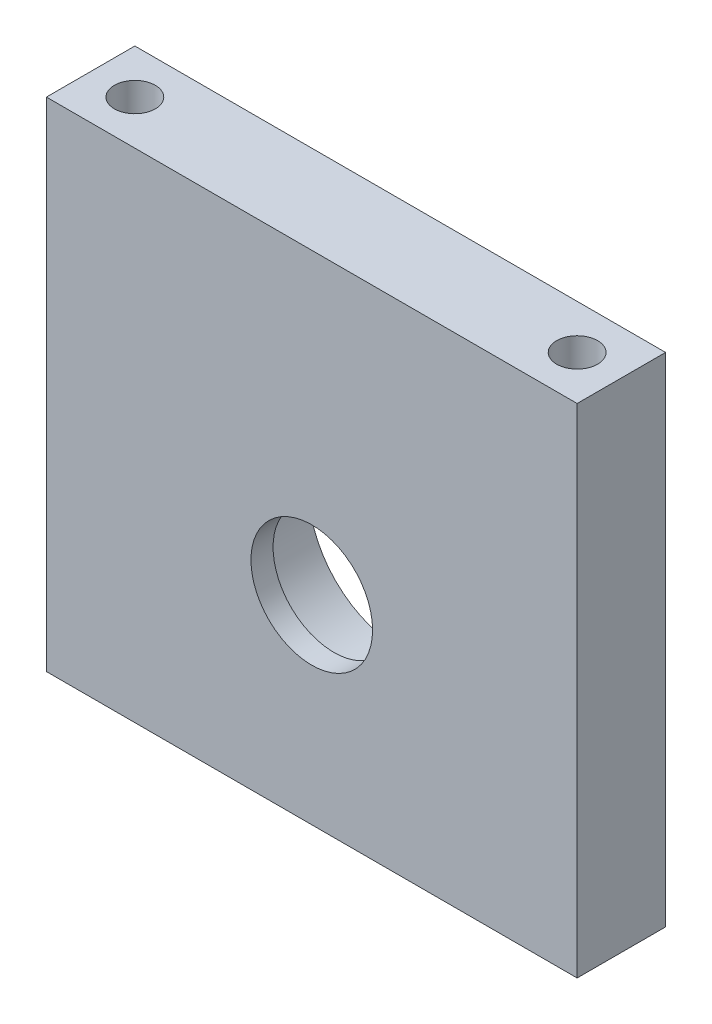
ISO-10303-21;
HEADER;
FILE_DESCRIPTION(('STEP AP214'),'2;1');
FILE_NAME('part.step','',(''),(''),'','','');
FILE_SCHEMA(('AUTOMOTIVE_DESIGN { 1 0 10303 214 1 1 1 1 }'));
ENDSEC;
DATA;
#1=APPLICATION_CONTEXT('core data for automotive mechanical design processes');
#2=APPLICATION_PROTOCOL_DEFINITION('international standard','automotive_design',2000,#1);
#3=PRODUCT_CONTEXT('',#1,'mechanical');
#4=PRODUCT('Part','Part','',(#3));
#5=PRODUCT_RELATED_PRODUCT_CATEGORY('part','',(#4));
#6=PRODUCT_DEFINITION_FORMATION('','',#4);
#7=PRODUCT_DEFINITION_CONTEXT('part definition',#1,'design');
#8=PRODUCT_DEFINITION('design','',#6,#7);
#9=PRODUCT_DEFINITION_SHAPE('','',#8);
#10=(LENGTH_UNIT() NAMED_UNIT(*) SI_UNIT(.MILLI.,.METRE.));
#11=(NAMED_UNIT(*) PLANE_ANGLE_UNIT() SI_UNIT($,.RADIAN.));
#12=(NAMED_UNIT(*) SI_UNIT($,.STERADIAN.) SOLID_ANGLE_UNIT());
#13=UNCERTAINTY_MEASURE_WITH_UNIT(LENGTH_MEASURE(1.E-05),#10,'distance_accuracy_value','');
#14=(GEOMETRIC_REPRESENTATION_CONTEXT(3) GLOBAL_UNCERTAINTY_ASSIGNED_CONTEXT((#13)) GLOBAL_UNIT_ASSIGNED_CONTEXT((#10,
#11,#12)) REPRESENTATION_CONTEXT('',''));
#15=CARTESIAN_POINT('',(0.,0.,0.));
#16=DIRECTION('',(0.,0.,1.));
#17=DIRECTION('',(1.,0.,0.));
#18=AXIS2_PLACEMENT_3D('',#15,#16,#17);
#19=CARTESIAN_POINT('',(24.,22.5,8.));
#20=DIRECTION('',(-1.,0.,0.));
#21=DIRECTION('',(0.,-1.,0.));
#22=AXIS2_PLACEMENT_3D('',#19,#20,#21);
#23=PLANE('',#22);
#24=DIRECTION('',(0.,1.,0.));
#25=VECTOR('',#24,1.);
#26=CARTESIAN_POINT('',(24.,22.5,0.));
#27=LINE('',#26,#25);
#28=CARTESIAN_POINT('',(24.,-22.5,0.));
#29=VERTEX_POINT('',#28);
#30=CARTESIAN_POINT('',(24.,22.5,0.));
#31=VERTEX_POINT('',#30);
#32=EDGE_CURVE('E131',#29,#31,#27,.T.);
#33=ORIENTED_EDGE('',*,*,#32,.T.);
#34=DIRECTION('',(0.,0.,-1.));
#35=VECTOR('',#34,1.);
#36=CARTESIAN_POINT('',(24.,22.5,8.));
#37=LINE('',#36,#35);
#38=CARTESIAN_POINT('',(24.,22.5,8.));
#39=VERTEX_POINT('',#38);
#40=EDGE_CURVE('E11',#39,#31,#37,.T.);
#41=ORIENTED_EDGE('',*,*,#40,.F.);
#42=DIRECTION('',(0.,1.,0.));
#43=VECTOR('',#42,1.);
#44=CARTESIAN_POINT('',(24.,22.5,8.));
#45=LINE('',#44,#43);
#46=CARTESIAN_POINT('',(24.,-22.5,8.));
#47=VERTEX_POINT('',#46);
#48=EDGE_CURVE('E132',#47,#39,#45,.T.);
#49=ORIENTED_EDGE('',*,*,#48,.F.);
#50=DIRECTION('',(0.,0.,-1.));
#51=VECTOR('',#50,1.);
#52=CARTESIAN_POINT('',(24.,-22.5,8.));
#53=LINE('',#52,#51);
#54=EDGE_CURVE('E138',#47,#29,#53,.T.);
#55=ORIENTED_EDGE('',*,*,#54,.T.);
#56=EDGE_LOOP('',(#33,#41,#49,#55));
#57=FACE_BOUND('',#56,.T.);
#58=ADVANCED_FACE('F32',(#57),#23,.F.);
#59=CARTESIAN_POINT('',(-24.,22.5,8.));
#60=DIRECTION('',(0.,-1.,0.));
#61=DIRECTION('',(0.,0.,-1.));
#62=AXIS2_PLACEMENT_3D('',#59,#60,#61);
#63=PLANE('',#62);
#64=CARTESIAN_POINT('',(20.,22.5,4.));
#65=DIRECTION('',(0.,1.,0.));
#66=DIRECTION('',(0.,0.,1.));
#67=AXIS2_PLACEMENT_3D('',#64,#65,#66);
#68=CIRCLE('',#67,1.85);
#69=CARTESIAN_POINT('',(20.,22.5,5.85));
#70=VERTEX_POINT('',#69);
#71=EDGE_CURVE('E97',#70,#70,#68,.T.);
#72=ORIENTED_EDGE('',*,*,#71,.F.);
#73=EDGE_LOOP('',(#72));
#74=FACE_BOUND('',#73,.T.);
#75=CARTESIAN_POINT('',(-20.,22.5,4.));
#76=DIRECTION('',(0.,1.,0.));
#77=DIRECTION('',(0.,0.,1.));
#78=AXIS2_PLACEMENT_3D('',#75,#76,#77);
#79=CIRCLE('',#78,1.85);
#80=CARTESIAN_POINT('',(-20.,22.5,5.85));
#81=VERTEX_POINT('',#80);
#82=EDGE_CURVE('E96',#81,#81,#79,.T.);
#83=ORIENTED_EDGE('',*,*,#82,.F.);
#84=EDGE_LOOP('',(#83));
#85=FACE_BOUND('',#84,.T.);
#86=DIRECTION('',(-1.,0.,0.));
#87=VECTOR('',#86,1.);
#88=CARTESIAN_POINT('',(-24.,22.5,0.));
#89=LINE('',#88,#87);
#90=CARTESIAN_POINT('',(-24.,22.5,0.));
#91=VERTEX_POINT('',#90);
#92=EDGE_CURVE('E141',#31,#91,#89,.T.);
#93=ORIENTED_EDGE('',*,*,#92,.T.);
#94=DIRECTION('',(0.,0.,-1.));
#95=VECTOR('',#94,1.);
#96=CARTESIAN_POINT('',(-24.,22.5,8.));
#97=LINE('',#96,#95);
#98=CARTESIAN_POINT('',(-24.,22.5,8.));
#99=VERTEX_POINT('',#98);
#100=EDGE_CURVE('E40',#99,#91,#97,.T.);
#101=ORIENTED_EDGE('',*,*,#100,.F.);
#102=DIRECTION('',(-1.,0.,0.));
#103=VECTOR('',#102,1.);
#104=CARTESIAN_POINT('',(-24.,22.5,8.));
#105=LINE('',#104,#103);
#106=EDGE_CURVE('E79',#39,#99,#105,.T.);
#107=ORIENTED_EDGE('',*,*,#106,.F.);
#108=ORIENTED_EDGE('',*,*,#40,.T.);
#109=EDGE_LOOP('',(#93,#101,#107,#108));
#110=FACE_BOUND('',#109,.T.);
#111=ADVANCED_FACE('F166',(#74,#85,#110),#63,.F.);
#112=CARTESIAN_POINT('',(-24.,22.5,8.));
#113=DIRECTION('',(1.,0.,0.));
#114=DIRECTION('',(0.,1.,0.));
#115=AXIS2_PLACEMENT_3D('',#112,#113,#114);
#116=PLANE('',#115);
#117=DIRECTION('',(0.,-1.,0.));
#118=VECTOR('',#117,1.);
#119=CARTESIAN_POINT('',(-24.,22.5,0.));
#120=LINE('',#119,#118);
#121=CARTESIAN_POINT('',(-24.,-22.5,0.));
#122=VERTEX_POINT('',#121);
#123=EDGE_CURVE('E66',#91,#122,#120,.T.);
#124=ORIENTED_EDGE('',*,*,#123,.T.);
#125=DIRECTION('',(0.,0.,-1.));
#126=VECTOR('',#125,1.);
#127=CARTESIAN_POINT('',(-24.,-22.5,8.));
#128=LINE('',#127,#126);
#129=CARTESIAN_POINT('',(-24.,-22.5,8.));
#130=VERTEX_POINT('',#129);
#131=EDGE_CURVE('E146',#130,#122,#128,.T.);
#132=ORIENTED_EDGE('',*,*,#131,.F.);
#133=DIRECTION('',(0.,-1.,0.));
#134=VECTOR('',#133,1.);
#135=CARTESIAN_POINT('',(-24.,22.5,8.));
#136=LINE('',#135,#134);
#137=EDGE_CURVE('E135',#99,#130,#136,.T.);
#138=ORIENTED_EDGE('',*,*,#137,.F.);
#139=ORIENTED_EDGE('',*,*,#100,.T.);
#140=EDGE_LOOP('',(#124,#132,#138,#139));
#141=FACE_BOUND('',#140,.T.);
#142=ADVANCED_FACE('F148',(#141),#116,.F.);
#143=CARTESIAN_POINT('',(-24.,-22.5,8.));
#144=DIRECTION('',(0.,1.,0.));
#145=DIRECTION('',(0.,0.,1.));
#146=AXIS2_PLACEMENT_3D('',#143,#144,#145);
#147=PLANE('',#146);
#148=CARTESIAN_POINT('',(-20.,-22.5,4.));
#149=DIRECTION('',(0.,-1.,0.));
#150=DIRECTION('',(0.,0.,-1.));
#151=AXIS2_PLACEMENT_3D('',#148,#149,#150);
#152=CIRCLE('',#151,1.75);
#153=CARTESIAN_POINT('',(-20.,-22.5,2.25));
#154=VERTEX_POINT('',#153);
#155=EDGE_CURVE('E112',#154,#154,#152,.T.);
#156=ORIENTED_EDGE('',*,*,#155,.F.);
#157=EDGE_LOOP('',(#156));
#158=FACE_BOUND('',#157,.T.);
#159=CARTESIAN_POINT('',(20.,-22.5,4.));
#160=DIRECTION('',(0.,-1.,0.));
#161=DIRECTION('',(0.,0.,-1.));
#162=AXIS2_PLACEMENT_3D('',#159,#160,#161);
#163=CIRCLE('',#162,1.75);
#164=CARTESIAN_POINT('',(20.,-22.5,2.25));
#165=VERTEX_POINT('',#164);
#166=EDGE_CURVE('E107',#165,#165,#163,.T.);
#167=ORIENTED_EDGE('',*,*,#166,.F.);
#168=EDGE_LOOP('',(#167));
#169=FACE_BOUND('',#168,.T.);
#170=DIRECTION('',(1.,0.,0.));
#171=VECTOR('',#170,1.);
#172=CARTESIAN_POINT('',(-24.,-22.5,0.));
#173=LINE('',#172,#171);
#174=EDGE_CURVE('E72',#122,#29,#173,.T.);
#175=ORIENTED_EDGE('',*,*,#174,.T.);
#176=ORIENTED_EDGE('',*,*,#54,.F.);
#177=DIRECTION('',(1.,0.,0.));
#178=VECTOR('',#177,1.);
#179=CARTESIAN_POINT('',(-24.,-22.5,8.));
#180=LINE('',#179,#178);
#181=EDGE_CURVE('E48',#130,#47,#180,.T.);
#182=ORIENTED_EDGE('',*,*,#181,.F.);
#183=ORIENTED_EDGE('',*,*,#131,.T.);
#184=EDGE_LOOP('',(#175,#176,#182,#183));
#185=FACE_BOUND('',#184,.T.);
#186=ADVANCED_FACE('F155',(#158,#169,#185),#147,.F.);
#187=CARTESIAN_POINT('',(0.,0.,8.));
#188=DIRECTION('',(0.,0.,1.));
#189=DIRECTION('',(1.,0.,0.));
#190=AXIS2_PLACEMENT_3D('',#187,#188,#189);
#191=PLANE('',#190);
#192=CARTESIAN_POINT('',(0.,-4.49999999999999,8.));
#193=DIRECTION('',(0.,0.,1.));
#194=DIRECTION('',(1.,0.,0.));
#195=AXIS2_PLACEMENT_3D('',#192,#193,#194);
#196=CIRCLE('',#195,5.5);
#197=CARTESIAN_POINT('',(5.5,-4.49999999999999,8.));
#198=VERTEX_POINT('',#197);
#199=EDGE_CURVE('E128',#198,#198,#196,.T.);
#200=ORIENTED_EDGE('',*,*,#199,.F.);
#201=EDGE_LOOP('',(#200));
#202=FACE_BOUND('',#201,.T.);
#203=ORIENTED_EDGE('',*,*,#48,.T.);
#204=ORIENTED_EDGE('',*,*,#106,.T.);
#205=ORIENTED_EDGE('',*,*,#137,.T.);
#206=ORIENTED_EDGE('',*,*,#181,.T.);
#207=EDGE_LOOP('',(#203,#204,#205,#206));
#208=FACE_BOUND('',#207,.T.);
#209=ADVANCED_FACE('F157',(#202,#208),#191,.T.);
#210=CARTESIAN_POINT('',(0.,0.,0.));
#211=DIRECTION('',(0.,0.,1.));
#212=DIRECTION('',(1.,0.,0.));
#213=AXIS2_PLACEMENT_3D('',#210,#211,#212);
#214=PLANE('',#213);
#215=CARTESIAN_POINT('',(0.,-4.49999999999999,0.));
#216=DIRECTION('',(0.,0.,-1.));
#217=DIRECTION('',(-1.,0.,0.));
#218=AXIS2_PLACEMENT_3D('',#215,#216,#217);
#219=CIRCLE('',#218,8.25);
#220=CARTESIAN_POINT('',(-8.25,-4.49999999999999,0.));
#221=VERTEX_POINT('',#220);
#222=EDGE_CURVE('E111',#221,#221,#219,.T.);
#223=ORIENTED_EDGE('',*,*,#222,.F.);
#224=EDGE_LOOP('',(#223));
#225=FACE_BOUND('',#224,.T.);
#226=ORIENTED_EDGE('',*,*,#32,.F.);
#227=ORIENTED_EDGE('',*,*,#174,.F.);
#228=ORIENTED_EDGE('',*,*,#123,.F.);
#229=ORIENTED_EDGE('',*,*,#92,.F.);
#230=EDGE_LOOP('',(#226,#227,#228,#229));
#231=FACE_BOUND('',#230,.T.);
#232=ADVANCED_FACE('F151',(#225,#231),#214,.F.);
#233=CARTESIAN_POINT('',(0.,-4.49999999999999,6.));
#234=DIRECTION('',(0.,0.,1.));
#235=DIRECTION('',(1.,0.,0.));
#236=AXIS2_PLACEMENT_3D('',#233,#234,#235);
#237=CYLINDRICAL_SURFACE('',#236,5.5);
#238=CARTESIAN_POINT('',(0.,-4.49999999999999,6.));
#239=DIRECTION('',(0.,0.,1.));
#240=DIRECTION('',(1.,0.,0.));
#241=AXIS2_PLACEMENT_3D('',#238,#239,#240);
#242=CIRCLE('',#241,5.5);
#243=CARTESIAN_POINT('',(5.5,-4.49999999999999,6.));
#244=VERTEX_POINT('',#243);
#245=EDGE_CURVE('E123',#244,#244,#242,.T.);
#246=ORIENTED_EDGE('',*,*,#245,.F.);
#247=EDGE_LOOP('',(#246));
#248=FACE_BOUND('',#247,.T.);
#249=ORIENTED_EDGE('',*,*,#199,.T.);
#250=EDGE_LOOP('',(#249));
#251=FACE_BOUND('',#250,.T.);
#252=ADVANCED_FACE('F214',(#248,#251),#237,.F.);
#253=CARTESIAN_POINT('',(0.,-4.49999999999999,6.));
#254=DIRECTION('',(0.,0.,-1.));
#255=DIRECTION('',(-1.,0.,0.));
#256=AXIS2_PLACEMENT_3D('',#253,#254,#255);
#257=PLANE('',#256);
#258=CARTESIAN_POINT('',(0.,-4.49999999999999,6.));
#259=DIRECTION('',(0.,0.,-1.));
#260=DIRECTION('',(-1.,0.,0.));
#261=AXIS2_PLACEMENT_3D('',#258,#259,#260);
#262=CIRCLE('',#261,8.25);
#263=CARTESIAN_POINT('',(-8.25,-4.49999999999999,6.));
#264=VERTEX_POINT('',#263);
#265=EDGE_CURVE('E120',#264,#264,#262,.T.);
#266=ORIENTED_EDGE('',*,*,#265,.T.);
#267=EDGE_LOOP('',(#266));
#268=FACE_BOUND('',#267,.T.);
#269=ORIENTED_EDGE('',*,*,#245,.T.);
#270=EDGE_LOOP('',(#269));
#271=FACE_BOUND('',#270,.T.);
#272=ADVANCED_FACE('F211',(#268,#271),#257,.T.);
#273=CARTESIAN_POINT('',(0.,-4.49999999999999,6.));
#274=DIRECTION('',(0.,0.,-1.));
#275=DIRECTION('',(-1.,0.,0.));
#276=AXIS2_PLACEMENT_3D('',#273,#274,#275);
#277=CYLINDRICAL_SURFACE('',#276,8.25);
#278=ORIENTED_EDGE('',*,*,#265,.F.);
#279=EDGE_LOOP('',(#278));
#280=FACE_BOUND('',#279,.T.);
#281=ORIENTED_EDGE('',*,*,#222,.T.);
#282=EDGE_LOOP('',(#281));
#283=FACE_BOUND('',#282,.T.);
#284=ADVANCED_FACE('F209',(#280,#283),#277,.F.);
#285=CARTESIAN_POINT('',(20.,-12.5,4.));
#286=DIRECTION('',(0.,-1.,0.));
#287=DIRECTION('',(0.,0.,-1.));
#288=AXIS2_PLACEMENT_3D('',#285,#286,#287);
#289=CYLINDRICAL_SURFACE('',#288,1.75);
#290=CARTESIAN_POINT('',(20.,-12.5,4.));
#291=DIRECTION('',(0.,-1.,0.));
#292=DIRECTION('',(0.,0.,-1.));
#293=AXIS2_PLACEMENT_3D('',#290,#291,#292);
#294=CIRCLE('',#293,1.75);
#295=CARTESIAN_POINT('',(20.,-12.5,2.25));
#296=VERTEX_POINT('',#295);
#297=EDGE_CURVE('E115',#296,#296,#294,.T.);
#298=ORIENTED_EDGE('',*,*,#297,.F.);
#299=EDGE_LOOP('',(#298));
#300=FACE_BOUND('',#299,.T.);
#301=ORIENTED_EDGE('',*,*,#166,.T.);
#302=EDGE_LOOP('',(#301));
#303=FACE_BOUND('',#302,.T.);
#304=ADVANCED_FACE('F205',(#300,#303),#289,.F.);
#305=CARTESIAN_POINT('',(20.,-12.5,4.));
#306=DIRECTION('',(0.,-1.,0.));
#307=DIRECTION('',(0.,0.,-1.));
#308=AXIS2_PLACEMENT_3D('',#305,#306,#307);
#309=PLANE('',#308);
#310=ORIENTED_EDGE('',*,*,#297,.T.);
#311=EDGE_LOOP('',(#310));
#312=FACE_BOUND('',#311,.T.);
#313=ADVANCED_FACE('F201',(#312),#309,.T.);
#314=CARTESIAN_POINT('',(-20.,-12.5,4.));
#315=DIRECTION('',(0.,-1.,0.));
#316=DIRECTION('',(0.,0.,-1.));
#317=AXIS2_PLACEMENT_3D('',#314,#315,#316);
#318=CYLINDRICAL_SURFACE('',#317,1.75);
#319=CARTESIAN_POINT('',(-20.,-12.5,4.));
#320=DIRECTION('',(0.,-1.,0.));
#321=DIRECTION('',(0.,0.,-1.));
#322=AXIS2_PLACEMENT_3D('',#319,#320,#321);
#323=CIRCLE('',#322,1.75);
#324=CARTESIAN_POINT('',(-20.,-12.5,2.25));
#325=VERTEX_POINT('',#324);
#326=EDGE_CURVE('E108',#325,#325,#323,.T.);
#327=ORIENTED_EDGE('',*,*,#326,.F.);
#328=EDGE_LOOP('',(#327));
#329=FACE_BOUND('',#328,.T.);
#330=ORIENTED_EDGE('',*,*,#155,.T.);
#331=EDGE_LOOP('',(#330));
#332=FACE_BOUND('',#331,.T.);
#333=ADVANCED_FACE('F197',(#329,#332),#318,.F.);
#334=CARTESIAN_POINT('',(-20.,-12.5,4.));
#335=DIRECTION('',(0.,-1.,0.));
#336=DIRECTION('',(0.,0.,-1.));
#337=AXIS2_PLACEMENT_3D('',#334,#335,#336);
#338=PLANE('',#337);
#339=ORIENTED_EDGE('',*,*,#326,.T.);
#340=EDGE_LOOP('',(#339));
#341=FACE_BOUND('',#340,.T.);
#342=ADVANCED_FACE('F189',(#341),#338,.T.);
#343=CARTESIAN_POINT('',(-20.,12.5,4.));
#344=DIRECTION('',(0.,1.,0.));
#345=DIRECTION('',(0.,0.,1.));
#346=AXIS2_PLACEMENT_3D('',#343,#344,#345);
#347=CONICAL_SURFACE('',#346,1.85,1.02974425867665);
#348=CARTESIAN_POINT('',(-20.,11.388407854799,4.));
#349=VERTEX_POINT('',#348);
#350=VERTEX_LOOP('',#349);
#351=FACE_BOUND('',#350,.T.);
#352=CARTESIAN_POINT('',(-20.,12.5,4.));
#353=DIRECTION('',(0.,1.,0.));
#354=DIRECTION('',(0.,0.,1.));
#355=AXIS2_PLACEMENT_3D('',#352,#353,#354);
#356=CIRCLE('',#355,1.85);
#357=CARTESIAN_POINT('',(-20.,12.5,5.85));
#358=VERTEX_POINT('',#357);
#359=EDGE_CURVE('E100',#358,#358,#356,.T.);
#360=ORIENTED_EDGE('',*,*,#359,.T.);
#361=EDGE_LOOP('',(#360));
#362=FACE_BOUND('',#361,.T.);
#363=ADVANCED_FACE('F183',(#351,#362),#347,.F.);
#364=CARTESIAN_POINT('',(-20.,22.5,4.));
#365=DIRECTION('',(0.,1.,0.));
#366=DIRECTION('',(0.,0.,1.));
#367=AXIS2_PLACEMENT_3D('',#364,#365,#366);
#368=CYLINDRICAL_SURFACE('',#367,1.85);
#369=ORIENTED_EDGE('',*,*,#359,.F.);
#370=EDGE_LOOP('',(#369));
#371=FACE_BOUND('',#370,.T.);
#372=ORIENTED_EDGE('',*,*,#82,.T.);
#373=EDGE_LOOP('',(#372));
#374=FACE_BOUND('',#373,.T.);
#375=ADVANCED_FACE('F90',(#371,#374),#368,.F.);
#376=CARTESIAN_POINT('',(20.,12.5,4.));
#377=DIRECTION('',(0.,1.,0.));
#378=DIRECTION('',(0.,0.,1.));
#379=AXIS2_PLACEMENT_3D('',#376,#377,#378);
#380=CONICAL_SURFACE('',#379,1.85,1.02974425867665);
#381=CARTESIAN_POINT('',(20.,11.388407854799,4.));
#382=VERTEX_POINT('',#381);
#383=VERTEX_LOOP('',#382);
#384=FACE_BOUND('',#383,.T.);
#385=CARTESIAN_POINT('',(20.,12.5,4.));
#386=DIRECTION('',(0.,1.,0.));
#387=DIRECTION('',(0.,0.,1.));
#388=AXIS2_PLACEMENT_3D('',#385,#386,#387);
#389=CIRCLE('',#388,1.85);
#390=CARTESIAN_POINT('',(20.,12.5,5.85));
#391=VERTEX_POINT('',#390);
#392=EDGE_CURVE('E94',#391,#391,#389,.T.);
#393=ORIENTED_EDGE('',*,*,#392,.T.);
#394=EDGE_LOOP('',(#393));
#395=FACE_BOUND('',#394,.T.);
#396=ADVANCED_FACE('F86',(#384,#395),#380,.F.);
#397=CARTESIAN_POINT('',(20.,22.5,4.));
#398=DIRECTION('',(0.,1.,0.));
#399=DIRECTION('',(0.,0.,1.));
#400=AXIS2_PLACEMENT_3D('',#397,#398,#399);
#401=CYLINDRICAL_SURFACE('',#400,1.85);
#402=ORIENTED_EDGE('',*,*,#392,.F.);
#403=EDGE_LOOP('',(#402));
#404=FACE_BOUND('',#403,.T.);
#405=ORIENTED_EDGE('',*,*,#71,.T.);
#406=EDGE_LOOP('',(#405));
#407=FACE_BOUND('',#406,.T.);
#408=ADVANCED_FACE('F89',(#404,#407),#401,.F.);
#409=CLOSED_SHELL('',(#58,#111,#142,#186,#209,#232,#252,#272,#284,#304,#313,#333,#342,#363,#375,
#396,#408));
#410=MANIFOLD_SOLID_BREP('B2',#409);
#411=ADVANCED_BREP_SHAPE_REPRESENTATION('',(#18,#410),#14);
#412=SHAPE_DEFINITION_REPRESENTATION(#9,#411);
ENDSEC;
END-ISO-10303-21;
